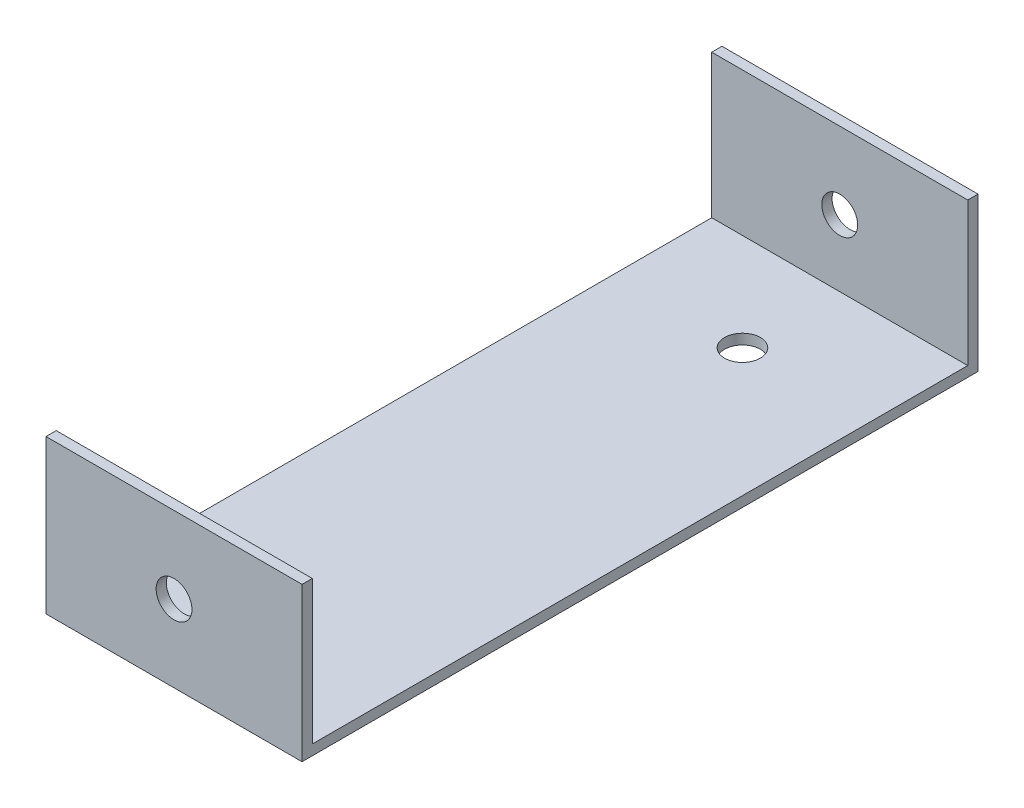
ISO-10303-21;
HEADER;
FILE_DESCRIPTION(('STEP AP214'),'2;1');
FILE_NAME('part.step','',(''),(''),'','','');
FILE_SCHEMA(('AUTOMOTIVE_DESIGN { 1 0 10303 214 1 1 1 1 }'));
ENDSEC;
DATA;
#1=APPLICATION_CONTEXT('core data for automotive mechanical design processes');
#2=APPLICATION_PROTOCOL_DEFINITION('international standard','automotive_design',2000,#1);
#3=PRODUCT_CONTEXT('',#1,'mechanical');
#4=PRODUCT('Part','Part','',(#3));
#5=PRODUCT_RELATED_PRODUCT_CATEGORY('part','',(#4));
#6=PRODUCT_DEFINITION_FORMATION('','',#4);
#7=PRODUCT_DEFINITION_CONTEXT('part definition',#1,'design');
#8=PRODUCT_DEFINITION('design','',#6,#7);
#9=PRODUCT_DEFINITION_SHAPE('','',#8);
#10=(LENGTH_UNIT() NAMED_UNIT(*) SI_UNIT(.MILLI.,.METRE.));
#11=(NAMED_UNIT(*) PLANE_ANGLE_UNIT() SI_UNIT($,.RADIAN.));
#12=(NAMED_UNIT(*) SI_UNIT($,.STERADIAN.) SOLID_ANGLE_UNIT());
#13=UNCERTAINTY_MEASURE_WITH_UNIT(LENGTH_MEASURE(1.E-05),#10,'distance_accuracy_value','');
#14=(GEOMETRIC_REPRESENTATION_CONTEXT(3) GLOBAL_UNCERTAINTY_ASSIGNED_CONTEXT((#13)) GLOBAL_UNIT_ASSIGNED_CONTEXT((#10,
#11,#12)) REPRESENTATION_CONTEXT('',''));
#15=CARTESIAN_POINT('',(0.,0.,0.));
#16=DIRECTION('',(0.,0.,1.));
#17=DIRECTION('',(1.,0.,0.));
#18=AXIS2_PLACEMENT_3D('',#15,#16,#17);
#19=CARTESIAN_POINT('',(425.,0.,64.));
#20=DIRECTION('',(0.,0.,1.));
#21=DIRECTION('',(0.,-1.,0.));
#22=AXIS2_PLACEMENT_3D('',#19,#20,#21);
#23=PLANE('',#22);
#24=CARTESIAN_POINT('',(400.,15.,64.));
#25=DIRECTION('',(0.,0.,1.));
#26=DIRECTION('',(0.,-1.,0.));
#27=AXIS2_PLACEMENT_3D('',#24,#25,#26);
#28=CIRCLE('',#27,3.49999999999989);
#29=CARTESIAN_POINT('',(400.,11.5000000000001,64.));
#30=VERTEX_POINT('',#29);
#31=EDGE_CURVE('E190',#30,#30,#28,.T.);
#32=ORIENTED_EDGE('',*,*,#31,.T.);
#33=EDGE_LOOP('',(#32));
#34=FACE_BOUND('',#33,.T.);
#35=DIRECTION('',(0.,1.,0.));
#36=VECTOR('',#35,1.);
#37=CARTESIAN_POINT('',(375.,0.,64.));
#38=LINE('',#37,#36);
#39=CARTESIAN_POINT('',(375.,2.,64.));
#40=VERTEX_POINT('',#39);
#41=CARTESIAN_POINT('',(375.,30.,64.));
#42=VERTEX_POINT('',#41);
#43=EDGE_CURVE('E130',#40,#42,#38,.T.);
#44=ORIENTED_EDGE('',*,*,#43,.T.);
#45=DIRECTION('',(-1.,0.,0.));
#46=VECTOR('',#45,1.);
#47=CARTESIAN_POINT('',(425.,30.,64.));
#48=LINE('',#47,#46);
#49=CARTESIAN_POINT('',(425.,30.,64.));
#50=VERTEX_POINT('',#49);
#51=EDGE_CURVE('E11',#50,#42,#48,.T.);
#52=ORIENTED_EDGE('',*,*,#51,.F.);
#53=DIRECTION('',(0.,1.,0.));
#54=VECTOR('',#53,1.);
#55=CARTESIAN_POINT('',(425.,0.,64.));
#56=LINE('',#55,#54);
#57=CARTESIAN_POINT('',(425.,2.,64.));
#58=VERTEX_POINT('',#57);
#59=EDGE_CURVE('E88',#58,#50,#56,.T.);
#60=ORIENTED_EDGE('',*,*,#59,.F.);
#61=DIRECTION('',(-1.,0.,0.));
#62=VECTOR('',#61,1.);
#63=CARTESIAN_POINT('',(425.,2.,64.));
#64=LINE('',#63,#62);
#65=EDGE_CURVE('E129',#58,#40,#64,.T.);
#66=ORIENTED_EDGE('',*,*,#65,.T.);
#67=EDGE_LOOP('',(#44,#52,#60,#66));
#68=FACE_BOUND('',#67,.T.);
#69=ADVANCED_FACE('F32',(#34,#68),#23,.F.);
#70=CARTESIAN_POINT('',(425.,30.,66.));
#71=DIRECTION('',(0.,1.,0.));
#72=DIRECTION('',(0.,0.,1.));
#73=AXIS2_PLACEMENT_3D('',#70,#71,#72);
#74=PLANE('',#73);
#75=DIRECTION('',(0.,0.,-1.));
#76=VECTOR('',#75,1.);
#77=CARTESIAN_POINT('',(375.,30.,66.));
#78=LINE('',#77,#76);
#79=CARTESIAN_POINT('',(375.,30.,66.));
#80=VERTEX_POINT('',#79);
#81=EDGE_CURVE('E133',#80,#42,#78,.T.);
#82=ORIENTED_EDGE('',*,*,#81,.F.);
#83=DIRECTION('',(-1.,0.,0.));
#84=VECTOR('',#83,1.);
#85=CARTESIAN_POINT('',(425.,30.,66.));
#86=LINE('',#85,#84);
#87=CARTESIAN_POINT('',(425.,30.,66.));
#88=VERTEX_POINT('',#87);
#89=EDGE_CURVE('E41',#88,#80,#86,.T.);
#90=ORIENTED_EDGE('',*,*,#89,.F.);
#91=DIRECTION('',(0.,0.,-1.));
#92=VECTOR('',#91,1.);
#93=CARTESIAN_POINT('',(425.,30.,66.));
#94=LINE('',#93,#92);
#95=EDGE_CURVE('E174',#88,#50,#94,.T.);
#96=ORIENTED_EDGE('',*,*,#95,.T.);
#97=ORIENTED_EDGE('',*,*,#51,.T.);
#98=EDGE_LOOP('',(#82,#90,#96,#97));
#99=FACE_BOUND('',#98,.T.);
#100=ADVANCED_FACE('F165',(#99),#74,.T.);
#101=CARTESIAN_POINT('',(425.,0.,66.));
#102=DIRECTION('',(0.,0.,1.));
#103=DIRECTION('',(0.,-1.,0.));
#104=AXIS2_PLACEMENT_3D('',#101,#102,#103);
#105=PLANE('',#104);
#106=CARTESIAN_POINT('',(400.,15.,66.));
#107=DIRECTION('',(0.,0.,1.));
#108=DIRECTION('',(1.,0.,0.));
#109=AXIS2_PLACEMENT_3D('',#106,#107,#108);
#110=CIRCLE('',#109,3.5);
#111=CARTESIAN_POINT('',(403.5,15.,66.));
#112=VERTEX_POINT('',#111);
#113=EDGE_CURVE('E196',#112,#112,#110,.T.);
#114=ORIENTED_EDGE('',*,*,#113,.F.);
#115=EDGE_LOOP('',(#114));
#116=FACE_BOUND('',#115,.T.);
#117=DIRECTION('',(0.,1.,0.));
#118=VECTOR('',#117,1.);
#119=CARTESIAN_POINT('',(375.,0.,66.));
#120=LINE('',#119,#118);
#121=CARTESIAN_POINT('',(375.,0.,66.));
#122=VERTEX_POINT('',#121);
#123=EDGE_CURVE('E137',#122,#80,#120,.T.);
#124=ORIENTED_EDGE('',*,*,#123,.F.);
#125=DIRECTION('',(-1.,0.,0.));
#126=VECTOR('',#125,1.);
#127=CARTESIAN_POINT('',(425.,0.,66.));
#128=LINE('',#127,#126);
#129=CARTESIAN_POINT('',(425.,0.,66.));
#130=VERTEX_POINT('',#129);
#131=EDGE_CURVE('E154',#130,#122,#128,.T.);
#132=ORIENTED_EDGE('',*,*,#131,.F.);
#133=DIRECTION('',(0.,1.,0.));
#134=VECTOR('',#133,1.);
#135=CARTESIAN_POINT('',(425.,0.,66.));
#136=LINE('',#135,#134);
#137=EDGE_CURVE('E162',#130,#88,#136,.T.);
#138=ORIENTED_EDGE('',*,*,#137,.T.);
#139=ORIENTED_EDGE('',*,*,#89,.T.);
#140=EDGE_LOOP('',(#124,#132,#138,#139));
#141=FACE_BOUND('',#140,.T.);
#142=ADVANCED_FACE('F160',(#116,#141),#105,.T.);
#143=CARTESIAN_POINT('',(425.,0.,66.));
#144=DIRECTION('',(0.,-1.,0.));
#145=DIRECTION('',(0.,0.,-1.));
#146=AXIS2_PLACEMENT_3D('',#143,#144,#145);
#147=PLANE('',#146);
#148=CARTESIAN_POINT('',(400.,0.,-45.));
#149=DIRECTION('',(0.,-1.,0.));
#150=DIRECTION('',(0.,0.,-1.));
#151=AXIS2_PLACEMENT_3D('',#148,#149,#150);
#152=CIRCLE('',#151,3.49999999999989);
#153=CARTESIAN_POINT('',(400.,0.,-48.4999999999999));
#154=VERTEX_POINT('',#153);
#155=EDGE_CURVE('E184',#154,#154,#152,.T.);
#156=ORIENTED_EDGE('',*,*,#155,.F.);
#157=EDGE_LOOP('',(#156));
#158=FACE_BOUND('',#157,.T.);
#159=CARTESIAN_POINT('',(400.,0.,45.));
#160=DIRECTION('',(0.,-1.,0.));
#161=DIRECTION('',(0.,0.,-1.));
#162=AXIS2_PLACEMENT_3D('',#159,#160,#161);
#163=CIRCLE('',#162,3.49999999999989);
#164=CARTESIAN_POINT('',(400.,0.,41.5000000000001));
#165=VERTEX_POINT('',#164);
#166=EDGE_CURVE('E134',#165,#165,#163,.T.);
#167=ORIENTED_EDGE('',*,*,#166,.F.);
#168=EDGE_LOOP('',(#167));
#169=FACE_BOUND('',#168,.T.);
#170=DIRECTION('',(0.,0.,1.));
#171=VECTOR('',#170,1.);
#172=CARTESIAN_POINT('',(375.,0.,66.));
#173=LINE('',#172,#171);
#174=CARTESIAN_POINT('',(375.,0.,-66.));
#175=VERTEX_POINT('',#174);
#176=EDGE_CURVE('E140',#175,#122,#173,.T.);
#177=ORIENTED_EDGE('',*,*,#176,.F.);
#178=DIRECTION('',(-1.,0.,0.));
#179=VECTOR('',#178,1.);
#180=CARTESIAN_POINT('',(425.,0.,-66.));
#181=LINE('',#180,#179);
#182=CARTESIAN_POINT('',(425.,0.,-66.));
#183=VERTEX_POINT('',#182);
#184=EDGE_CURVE('E152',#183,#175,#181,.T.);
#185=ORIENTED_EDGE('',*,*,#184,.F.);
#186=DIRECTION('',(0.,0.,1.));
#187=VECTOR('',#186,1.);
#188=CARTESIAN_POINT('',(425.,0.,66.));
#189=LINE('',#188,#187);
#190=EDGE_CURVE('E124',#183,#130,#189,.T.);
#191=ORIENTED_EDGE('',*,*,#190,.T.);
#192=ORIENTED_EDGE('',*,*,#131,.T.);
#193=EDGE_LOOP('',(#177,#185,#191,#192));
#194=FACE_BOUND('',#193,.T.);
#195=ADVANCED_FACE('F172',(#158,#169,#194),#147,.T.);
#196=CARTESIAN_POINT('',(425.,0.,-66.));
#197=DIRECTION('',(0.,0.,-1.));
#198=DIRECTION('',(0.,1.,0.));
#199=AXIS2_PLACEMENT_3D('',#196,#197,#198);
#200=PLANE('',#199);
#201=CARTESIAN_POINT('',(400.,15.,-66.));
#202=DIRECTION('',(0.,0.,-1.));
#203=DIRECTION('',(0.,1.,0.));
#204=AXIS2_PLACEMENT_3D('',#201,#202,#203);
#205=CIRCLE('',#204,3.49999999999989);
#206=CARTESIAN_POINT('',(400.,18.4999999999999,-66.));
#207=VERTEX_POINT('',#206);
#208=EDGE_CURVE('E193',#207,#207,#205,.T.);
#209=ORIENTED_EDGE('',*,*,#208,.F.);
#210=EDGE_LOOP('',(#209));
#211=FACE_BOUND('',#210,.T.);
#212=DIRECTION('',(0.,-1.,0.));
#213=VECTOR('',#212,1.);
#214=CARTESIAN_POINT('',(375.,0.,-66.));
#215=LINE('',#214,#213);
#216=CARTESIAN_POINT('',(375.,30.,-66.));
#217=VERTEX_POINT('',#216);
#218=EDGE_CURVE('E143',#217,#175,#215,.T.);
#219=ORIENTED_EDGE('',*,*,#218,.F.);
#220=DIRECTION('',(-1.,0.,0.));
#221=VECTOR('',#220,1.);
#222=CARTESIAN_POINT('',(425.,30.,-66.));
#223=LINE('',#222,#221);
#224=CARTESIAN_POINT('',(425.,30.,-66.));
#225=VERTEX_POINT('',#224);
#226=EDGE_CURVE('E112',#225,#217,#223,.T.);
#227=ORIENTED_EDGE('',*,*,#226,.F.);
#228=DIRECTION('',(0.,-1.,0.));
#229=VECTOR('',#228,1.);
#230=CARTESIAN_POINT('',(425.,0.,-66.));
#231=LINE('',#230,#229);
#232=EDGE_CURVE('E122',#225,#183,#231,.T.);
#233=ORIENTED_EDGE('',*,*,#232,.T.);
#234=ORIENTED_EDGE('',*,*,#184,.T.);
#235=EDGE_LOOP('',(#219,#227,#233,#234));
#236=FACE_BOUND('',#235,.T.);
#237=ADVANCED_FACE('F240',(#211,#236),#200,.T.);
#238=CARTESIAN_POINT('',(425.,30.,-64.));
#239=DIRECTION('',(0.,1.,0.));
#240=DIRECTION('',(0.,0.,1.));
#241=AXIS2_PLACEMENT_3D('',#238,#239,#240);
#242=PLANE('',#241);
#243=DIRECTION('',(0.,0.,-1.));
#244=VECTOR('',#243,1.);
#245=CARTESIAN_POINT('',(375.,30.,-64.));
#246=LINE('',#245,#244);
#247=CARTESIAN_POINT('',(375.,30.,-64.));
#248=VERTEX_POINT('',#247);
#249=EDGE_CURVE('E111',#248,#217,#246,.T.);
#250=ORIENTED_EDGE('',*,*,#249,.F.);
#251=DIRECTION('',(-1.,0.,0.));
#252=VECTOR('',#251,1.);
#253=CARTESIAN_POINT('',(425.,30.,-64.));
#254=LINE('',#253,#252);
#255=CARTESIAN_POINT('',(425.,30.,-64.));
#256=VERTEX_POINT('',#255);
#257=EDGE_CURVE('E105',#256,#248,#254,.T.);
#258=ORIENTED_EDGE('',*,*,#257,.F.);
#259=DIRECTION('',(0.,0.,-1.));
#260=VECTOR('',#259,1.);
#261=CARTESIAN_POINT('',(425.,30.,-64.));
#262=LINE('',#261,#260);
#263=EDGE_CURVE('E109',#256,#225,#262,.T.);
#264=ORIENTED_EDGE('',*,*,#263,.T.);
#265=ORIENTED_EDGE('',*,*,#226,.T.);
#266=EDGE_LOOP('',(#250,#258,#264,#265));
#267=FACE_BOUND('',#266,.T.);
#268=ADVANCED_FACE('F107',(#267),#242,.T.);
#269=CARTESIAN_POINT('',(425.,0.,-64.));
#270=DIRECTION('',(0.,0.,-1.));
#271=DIRECTION('',(0.,1.,0.));
#272=AXIS2_PLACEMENT_3D('',#269,#270,#271);
#273=PLANE('',#272);
#274=CARTESIAN_POINT('',(400.,15.,-64.));
#275=DIRECTION('',(0.,0.,-1.));
#276=DIRECTION('',(0.,1.,0.));
#277=AXIS2_PLACEMENT_3D('',#274,#275,#276);
#278=CIRCLE('',#277,3.49999999999989);
#279=CARTESIAN_POINT('',(400.,18.4999999999999,-64.));
#280=VERTEX_POINT('',#279);
#281=EDGE_CURVE('E35',#280,#280,#278,.T.);
#282=ORIENTED_EDGE('',*,*,#281,.T.);
#283=EDGE_LOOP('',(#282));
#284=FACE_BOUND('',#283,.T.);
#285=DIRECTION('',(0.,-1.,0.));
#286=VECTOR('',#285,1.);
#287=CARTESIAN_POINT('',(375.,0.,-64.));
#288=LINE('',#287,#286);
#289=CARTESIAN_POINT('',(375.,2.,-64.));
#290=VERTEX_POINT('',#289);
#291=EDGE_CURVE('E76',#248,#290,#288,.T.);
#292=ORIENTED_EDGE('',*,*,#291,.T.);
#293=DIRECTION('',(-1.,0.,0.));
#294=VECTOR('',#293,1.);
#295=CARTESIAN_POINT('',(425.,2.,-64.));
#296=LINE('',#295,#294);
#297=CARTESIAN_POINT('',(425.,2.,-64.));
#298=VERTEX_POINT('',#297);
#299=EDGE_CURVE('E113',#298,#290,#296,.T.);
#300=ORIENTED_EDGE('',*,*,#299,.F.);
#301=DIRECTION('',(0.,-1.,0.));
#302=VECTOR('',#301,1.);
#303=CARTESIAN_POINT('',(425.,0.,-64.));
#304=LINE('',#303,#302);
#305=EDGE_CURVE('E115',#256,#298,#304,.T.);
#306=ORIENTED_EDGE('',*,*,#305,.F.);
#307=ORIENTED_EDGE('',*,*,#257,.T.);
#308=EDGE_LOOP('',(#292,#300,#306,#307));
#309=FACE_BOUND('',#308,.T.);
#310=ADVANCED_FACE('F116',(#284,#309),#273,.F.);
#311=CARTESIAN_POINT('',(425.,2.,66.));
#312=DIRECTION('',(0.,-1.,0.));
#313=DIRECTION('',(0.,0.,-1.));
#314=AXIS2_PLACEMENT_3D('',#311,#312,#313);
#315=PLANE('',#314);
#316=CARTESIAN_POINT('',(400.,2.,-45.));
#317=DIRECTION('',(0.,1.,0.));
#318=DIRECTION('',(0.,0.,1.));
#319=AXIS2_PLACEMENT_3D('',#316,#317,#318);
#320=CIRCLE('',#319,3.5);
#321=CARTESIAN_POINT('',(400.,2.,-41.5));
#322=VERTEX_POINT('',#321);
#323=EDGE_CURVE('E187',#322,#322,#320,.T.);
#324=ORIENTED_EDGE('',*,*,#323,.F.);
#325=EDGE_LOOP('',(#324));
#326=FACE_BOUND('',#325,.T.);
#327=CARTESIAN_POINT('',(400.,2.,45.));
#328=DIRECTION('',(0.,1.,0.));
#329=DIRECTION('',(0.,0.,1.));
#330=AXIS2_PLACEMENT_3D('',#327,#328,#329);
#331=CIRCLE('',#330,3.5);
#332=CARTESIAN_POINT('',(400.,2.,48.5));
#333=VERTEX_POINT('',#332);
#334=EDGE_CURVE('E181',#333,#333,#331,.T.);
#335=ORIENTED_EDGE('',*,*,#334,.F.);
#336=EDGE_LOOP('',(#335));
#337=FACE_BOUND('',#336,.T.);
#338=DIRECTION('',(0.,0.,-1.));
#339=VECTOR('',#338,1.);
#340=CARTESIAN_POINT('',(375.,2.,66.));
#341=LINE('',#340,#339);
#342=EDGE_CURVE('E82',#290,#40,#341,.F.);
#343=ORIENTED_EDGE('',*,*,#342,.T.);
#344=ORIENTED_EDGE('',*,*,#65,.F.);
#345=DIRECTION('',(0.,0.,-1.));
#346=VECTOR('',#345,1.);
#347=CARTESIAN_POINT('',(425.,2.,66.));
#348=LINE('',#347,#346);
#349=EDGE_CURVE('E49',#298,#58,#348,.F.);
#350=ORIENTED_EDGE('',*,*,#349,.F.);
#351=ORIENTED_EDGE('',*,*,#299,.T.);
#352=EDGE_LOOP('',(#343,#344,#350,#351));
#353=FACE_BOUND('',#352,.T.);
#354=ADVANCED_FACE('F224',(#326,#337,#353),#315,.F.);
#355=CARTESIAN_POINT('',(425.,0.,0.));
#356=DIRECTION('',(-1.,0.,0.));
#357=DIRECTION('',(0.,0.,1.));
#358=AXIS2_PLACEMENT_3D('',#355,#356,#357);
#359=PLANE('',#358);
#360=ORIENTED_EDGE('',*,*,#59,.T.);
#361=ORIENTED_EDGE('',*,*,#95,.F.);
#362=ORIENTED_EDGE('',*,*,#137,.F.);
#363=ORIENTED_EDGE('',*,*,#190,.F.);
#364=ORIENTED_EDGE('',*,*,#232,.F.);
#365=ORIENTED_EDGE('',*,*,#263,.F.);
#366=ORIENTED_EDGE('',*,*,#305,.T.);
#367=ORIENTED_EDGE('',*,*,#349,.T.);
#368=EDGE_LOOP('',(#360,#361,#362,#363,#364,#365,#366,#367));
#369=FACE_BOUND('',#368,.T.);
#370=ADVANCED_FACE('F119',(#369),#359,.F.);
#371=CARTESIAN_POINT('',(375.,0.,0.));
#372=DIRECTION('',(-1.,0.,0.));
#373=DIRECTION('',(0.,0.,1.));
#374=AXIS2_PLACEMENT_3D('',#371,#372,#373);
#375=PLANE('',#374);
#376=ORIENTED_EDGE('',*,*,#43,.F.);
#377=ORIENTED_EDGE('',*,*,#342,.F.);
#378=ORIENTED_EDGE('',*,*,#291,.F.);
#379=ORIENTED_EDGE('',*,*,#249,.T.);
#380=ORIENTED_EDGE('',*,*,#218,.T.);
#381=ORIENTED_EDGE('',*,*,#176,.T.);
#382=ORIENTED_EDGE('',*,*,#123,.T.);
#383=ORIENTED_EDGE('',*,*,#81,.T.);
#384=EDGE_LOOP('',(#376,#377,#378,#379,#380,#381,#382,#383));
#385=FACE_BOUND('',#384,.T.);
#386=ADVANCED_FACE('F168',(#385),#375,.T.);
#387=CARTESIAN_POINT('',(400.,2.,45.));
#388=DIRECTION('',(0.,1.,0.));
#389=DIRECTION('',(0.,0.,1.));
#390=AXIS2_PLACEMENT_3D('',#387,#388,#389);
#391=CYLINDRICAL_SURFACE('',#390,3.49999999999989);
#392=ORIENTED_EDGE('',*,*,#166,.T.);
#393=EDGE_LOOP('',(#392));
#394=FACE_BOUND('',#393,.T.);
#395=ORIENTED_EDGE('',*,*,#334,.T.);
#396=EDGE_LOOP('',(#395));
#397=FACE_BOUND('',#396,.T.);
#398=ADVANCED_FACE('F214',(#394,#397),#391,.F.);
#399=CARTESIAN_POINT('',(400.,2.,-45.));
#400=DIRECTION('',(0.,1.,0.));
#401=DIRECTION('',(0.,0.,1.));
#402=AXIS2_PLACEMENT_3D('',#399,#400,#401);
#403=CYLINDRICAL_SURFACE('',#402,3.49999999999989);
#404=ORIENTED_EDGE('',*,*,#155,.T.);
#405=EDGE_LOOP('',(#404));
#406=FACE_BOUND('',#405,.T.);
#407=ORIENTED_EDGE('',*,*,#323,.T.);
#408=EDGE_LOOP('',(#407));
#409=FACE_BOUND('',#408,.T.);
#410=ADVANCED_FACE('F207',(#406,#409),#403,.F.);
#411=CARTESIAN_POINT('',(400.,15.,66.));
#412=DIRECTION('',(0.,0.,1.));
#413=DIRECTION('',(1.,0.,0.));
#414=AXIS2_PLACEMENT_3D('',#411,#412,#413);
#415=CYLINDRICAL_SURFACE('',#414,3.49999999999989);
#416=ORIENTED_EDGE('',*,*,#208,.T.);
#417=EDGE_LOOP('',(#416));
#418=FACE_BOUND('',#417,.T.);
#419=ORIENTED_EDGE('',*,*,#281,.F.);
#420=EDGE_LOOP('',(#419));
#421=FACE_BOUND('',#420,.T.);
#422=ADVANCED_FACE('F204',(#418,#421),#415,.F.);
#423=ORIENTED_EDGE('',*,*,#113,.T.);
#424=EDGE_LOOP('',(#423));
#425=FACE_BOUND('',#424,.T.);
#426=ORIENTED_EDGE('',*,*,#31,.F.);
#427=EDGE_LOOP('',(#426));
#428=FACE_BOUND('',#427,.T.);
#429=ADVANCED_FACE('F206',(#425,#428),#415,.F.);
#430=CLOSED_SHELL('',(#69,#100,#142,#195,#237,#268,#310,#354,#370,#386,#398,#410,#422,#429));
#431=MANIFOLD_SOLID_BREP('B2',#430);
#432=ADVANCED_BREP_SHAPE_REPRESENTATION('',(#18,#431),#14);
#433=SHAPE_DEFINITION_REPRESENTATION(#9,#432);
ENDSEC;
END-ISO-10303-21;
